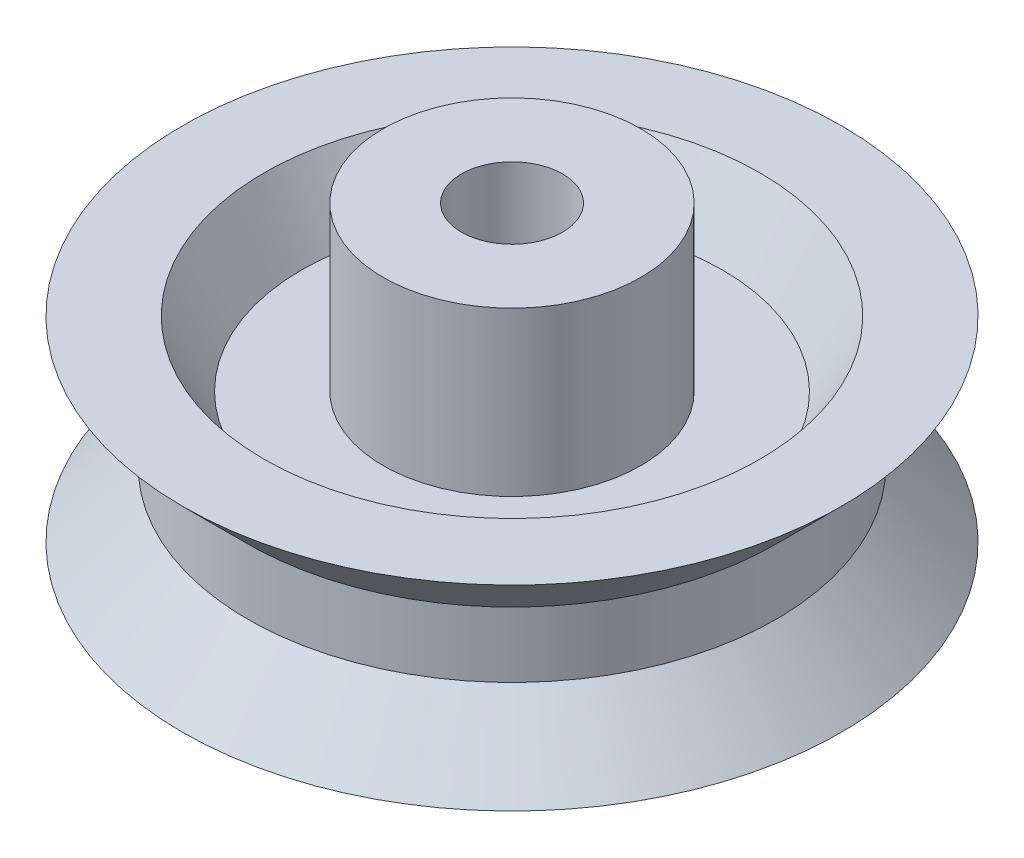
ISO-10303-21;
HEADER;
FILE_DESCRIPTION(('STEP AP214'),'2;1');
FILE_NAME('part.step','',(''),(''),'','','');
FILE_SCHEMA(('AUTOMOTIVE_DESIGN { 1 0 10303 214 1 1 1 1 }'));
ENDSEC;
DATA;
#1=APPLICATION_CONTEXT('core data for automotive mechanical design processes');
#2=APPLICATION_PROTOCOL_DEFINITION('international standard','automotive_design',2000,#1);
#3=PRODUCT_CONTEXT('',#1,'mechanical');
#4=PRODUCT('Part','Part','',(#3));
#5=PRODUCT_RELATED_PRODUCT_CATEGORY('part','',(#4));
#6=PRODUCT_DEFINITION_FORMATION('','',#4);
#7=PRODUCT_DEFINITION_CONTEXT('part definition',#1,'design');
#8=PRODUCT_DEFINITION('design','',#6,#7);
#9=PRODUCT_DEFINITION_SHAPE('','',#8);
#10=(LENGTH_UNIT() NAMED_UNIT(*) SI_UNIT(.MILLI.,.METRE.));
#11=(NAMED_UNIT(*) PLANE_ANGLE_UNIT() SI_UNIT($,.RADIAN.));
#12=(NAMED_UNIT(*) SI_UNIT($,.STERADIAN.) SOLID_ANGLE_UNIT());
#13=UNCERTAINTY_MEASURE_WITH_UNIT(LENGTH_MEASURE(1.E-05),#10,'distance_accuracy_value','');
#14=(GEOMETRIC_REPRESENTATION_CONTEXT(3) GLOBAL_UNCERTAINTY_ASSIGNED_CONTEXT((#13)) GLOBAL_UNIT_ASSIGNED_CONTEXT((#10,
#11,#12)) REPRESENTATION_CONTEXT('',''));
#15=CARTESIAN_POINT('',(0.,0.,0.));
#16=DIRECTION('',(0.,0.,1.));
#17=DIRECTION('',(1.,0.,0.));
#18=AXIS2_PLACEMENT_3D('',#15,#16,#17);
#19=CARTESIAN_POINT('',(0.,-4.99999999999999,-1.55));
#20=DIRECTION('',(0.,-1.,0.));
#21=DIRECTION('',(0.,0.,-1.));
#22=AXIS2_PLACEMENT_3D('',#19,#20,#21);
#23=PLANE('',#22);
#24=CARTESIAN_POINT('',(0.,-4.99999999999999,0.));
#25=DIRECTION('',(0.,-1.,0.));
#26=DIRECTION('',(0.,0.,-1.));
#27=AXIS2_PLACEMENT_3D('',#24,#25,#26);
#28=CIRCLE('',#27,3.94999999999998);
#29=CARTESIAN_POINT('',(0.,-4.99999999999999,-3.94999999999998));
#30=VERTEX_POINT('',#29);
#31=EDGE_CURVE('E10',#30,#30,#28,.T.);
#32=ORIENTED_EDGE('',*,*,#31,.T.);
#33=EDGE_LOOP('',(#32));
#34=FACE_BOUND('',#33,.T.);
#35=CARTESIAN_POINT('',(0.,-4.99999999999999,0.));
#36=DIRECTION('',(0.,-1.,0.));
#37=DIRECTION('',(0.,0.,-1.));
#38=AXIS2_PLACEMENT_3D('',#35,#36,#37);
#39=CIRCLE('',#38,1.55);
#40=CARTESIAN_POINT('',(0.,-4.99999999999999,-1.55));
#41=VERTEX_POINT('',#40);
#42=EDGE_CURVE('E77',#41,#41,#39,.T.);
#43=ORIENTED_EDGE('',*,*,#42,.F.);
#44=EDGE_LOOP('',(#43));
#45=FACE_BOUND('',#44,.T.);
#46=ADVANCED_FACE('F31',(#34,#45),#23,.T.);
#47=CARTESIAN_POINT('',(0.,0.,0.));
#48=DIRECTION('',(0.,-1.,0.));
#49=DIRECTION('',(0.,0.,-1.));
#50=AXIS2_PLACEMENT_3D('',#47,#48,#49);
#51=CYLINDRICAL_SURFACE('',#50,3.94999999999999);
#52=CARTESIAN_POINT('',(0.,0.,0.));
#53=DIRECTION('',(0.,-1.,0.));
#54=DIRECTION('',(0.,0.,-1.));
#55=AXIS2_PLACEMENT_3D('',#52,#53,#54);
#56=CIRCLE('',#55,3.95);
#57=CARTESIAN_POINT('',(0.,0.,-3.95));
#58=VERTEX_POINT('',#57);
#59=EDGE_CURVE('E37',#58,#58,#56,.T.);
#60=ORIENTED_EDGE('',*,*,#59,.T.);
#61=EDGE_LOOP('',(#60));
#62=FACE_BOUND('',#61,.T.);
#63=ORIENTED_EDGE('',*,*,#31,.F.);
#64=EDGE_LOOP('',(#63));
#65=FACE_BOUND('',#64,.T.);
#66=ADVANCED_FACE('F85',(#62,#65),#51,.T.);
#67=CARTESIAN_POINT('',(0.,0.,-3.95));
#68=DIRECTION('',(0.,-1.,0.));
#69=DIRECTION('',(0.,0.,-1.));
#70=AXIS2_PLACEMENT_3D('',#67,#68,#69);
#71=PLANE('',#70);
#72=CARTESIAN_POINT('',(0.,0.,0.));
#73=DIRECTION('',(0.,-1.,0.));
#74=DIRECTION('',(0.,0.,-1.));
#75=AXIS2_PLACEMENT_3D('',#72,#73,#74);
#76=CIRCLE('',#75,6.45);
#77=CARTESIAN_POINT('',(0.,0.,-6.45));
#78=VERTEX_POINT('',#77);
#79=EDGE_CURVE('E41',#78,#78,#76,.T.);
#80=ORIENTED_EDGE('',*,*,#79,.T.);
#81=EDGE_LOOP('',(#80));
#82=FACE_BOUND('',#81,.T.);
#83=ORIENTED_EDGE('',*,*,#59,.F.);
#84=EDGE_LOOP('',(#83));
#85=FACE_BOUND('',#84,.T.);
#86=ADVANCED_FACE('F89',(#82,#85),#71,.T.);
#87=CARTESIAN_POINT('',(0.,0.,0.));
#88=DIRECTION('',(0.,-1.,0.));
#89=DIRECTION('',(0.,0.,-1.));
#90=AXIS2_PLACEMENT_3D('',#87,#88,#89);
#91=CONICAL_SURFACE('',#90,6.45,0.52359877559825);
#92=CARTESIAN_POINT('',(0.,-1.99999999999998,0.));
#93=DIRECTION('',(0.,-1.,0.));
#94=DIRECTION('',(0.,0.,-1.));
#95=AXIS2_PLACEMENT_3D('',#92,#93,#94);
#96=CIRCLE('',#95,7.60470053837912);
#97=CARTESIAN_POINT('',(0.,-1.99999999999998,-7.60470053837912));
#98=VERTEX_POINT('',#97);
#99=EDGE_CURVE('E45',#98,#98,#96,.T.);
#100=ORIENTED_EDGE('',*,*,#99,.T.);
#101=EDGE_LOOP('',(#100));
#102=FACE_BOUND('',#101,.T.);
#103=ORIENTED_EDGE('',*,*,#79,.F.);
#104=EDGE_LOOP('',(#103));
#105=FACE_BOUND('',#104,.T.);
#106=ADVANCED_FACE('F93',(#102,#105),#91,.F.);
#107=CARTESIAN_POINT('',(0.,-1.99999999999998,-7.60470053837912));
#108=DIRECTION('',(0.,-1.,0.));
#109=DIRECTION('',(0.,0.,-1.));
#110=AXIS2_PLACEMENT_3D('',#107,#108,#109);
#111=PLANE('',#110);
#112=CARTESIAN_POINT('',(0.,-1.99999999999999,0.));
#113=DIRECTION('',(0.,-1.,0.));
#114=DIRECTION('',(0.,0.,-1.));
#115=AXIS2_PLACEMENT_3D('',#112,#113,#114);
#116=CIRCLE('',#115,10.1047005383792);
#117=CARTESIAN_POINT('',(0.,-1.99999999999999,-10.1047005383792));
#118=VERTEX_POINT('',#117);
#119=EDGE_CURVE('E50',#118,#118,#116,.T.);
#120=ORIENTED_EDGE('',*,*,#119,.T.);
#121=EDGE_LOOP('',(#120));
#122=FACE_BOUND('',#121,.T.);
#123=ORIENTED_EDGE('',*,*,#99,.F.);
#124=EDGE_LOOP('',(#123));
#125=FACE_BOUND('',#124,.T.);
#126=ADVANCED_FACE('F100',(#122,#125),#111,.T.);
#127=CARTESIAN_POINT('',(0.,-1.99999999999999,0.));
#128=DIRECTION('',(0.,-1.,0.));
#129=DIRECTION('',(0.,0.,-1.));
#130=AXIS2_PLACEMENT_3D('',#127,#128,#129);
#131=CONICAL_SURFACE('',#130,10.1047005383792,0.78539816339745);
#132=CARTESIAN_POINT('',(0.,0.,0.));
#133=DIRECTION('',(0.,-1.,0.));
#134=DIRECTION('',(0.,0.,-1.));
#135=AXIS2_PLACEMENT_3D('',#132,#133,#134);
#136=CIRCLE('',#135,8.10470053837923);
#137=CARTESIAN_POINT('',(0.,0.,-8.10470053837923));
#138=VERTEX_POINT('',#137);
#139=EDGE_CURVE('E53',#138,#138,#136,.T.);
#140=ORIENTED_EDGE('',*,*,#139,.T.);
#141=EDGE_LOOP('',(#140));
#142=FACE_BOUND('',#141,.T.);
#143=ORIENTED_EDGE('',*,*,#119,.F.);
#144=EDGE_LOOP('',(#143));
#145=FACE_BOUND('',#144,.T.);
#146=ADVANCED_FACE('F104',(#142,#145),#131,.T.);
#147=CARTESIAN_POINT('',(0.,0.,0.));
#148=DIRECTION('',(0.,-1.,0.));
#149=DIRECTION('',(0.,0.,-1.));
#150=AXIS2_PLACEMENT_3D('',#147,#148,#149);
#151=CYLINDRICAL_SURFACE('',#150,8.10470053837923);
#152=CARTESIAN_POINT('',(0.,2.00000000000001,0.));
#153=DIRECTION('',(0.,-1.,0.));
#154=DIRECTION('',(0.,0.,-1.));
#155=AXIS2_PLACEMENT_3D('',#152,#153,#154);
#156=CIRCLE('',#155,8.10470053837923);
#157=CARTESIAN_POINT('',(0.,2.00000000000001,-8.10470053837923));
#158=VERTEX_POINT('',#157);
#159=EDGE_CURVE('E56',#158,#158,#156,.T.);
#160=ORIENTED_EDGE('',*,*,#159,.T.);
#161=EDGE_LOOP('',(#160));
#162=FACE_BOUND('',#161,.T.);
#163=ORIENTED_EDGE('',*,*,#139,.F.);
#164=EDGE_LOOP('',(#163));
#165=FACE_BOUND('',#164,.T.);
#166=ADVANCED_FACE('F108',(#162,#165),#151,.T.);
#167=CARTESIAN_POINT('',(0.,2.00000000000001,0.));
#168=DIRECTION('',(0.,1.,0.));
#169=DIRECTION('',(0.,0.,1.));
#170=AXIS2_PLACEMENT_3D('',#167,#168,#169);
#171=CONICAL_SURFACE('',#170,8.10470053837923,0.785398163397423);
#172=CARTESIAN_POINT('',(0.,4.00000000000001,0.));
#173=DIRECTION('',(0.,-1.,0.));
#174=DIRECTION('',(0.,0.,-1.));
#175=AXIS2_PLACEMENT_3D('',#172,#173,#174);
#176=CIRCLE('',#175,10.1047005383791);
#177=CARTESIAN_POINT('',(0.,4.00000000000001,-10.1047005383791));
#178=VERTEX_POINT('',#177);
#179=EDGE_CURVE('E59',#178,#178,#176,.T.);
#180=ORIENTED_EDGE('',*,*,#179,.T.);
#181=EDGE_LOOP('',(#180));
#182=FACE_BOUND('',#181,.T.);
#183=ORIENTED_EDGE('',*,*,#159,.F.);
#184=EDGE_LOOP('',(#183));
#185=FACE_BOUND('',#184,.T.);
#186=ADVANCED_FACE('F112',(#182,#185),#171,.T.);
#187=CARTESIAN_POINT('',(0.,4.00000000000002,-10.1047005383791));
#188=DIRECTION('',(0.,1.,0.));
#189=DIRECTION('',(0.,0.,1.));
#190=AXIS2_PLACEMENT_3D('',#187,#188,#189);
#191=PLANE('',#190);
#192=CARTESIAN_POINT('',(0.,4.00000000000002,0.));
#193=DIRECTION('',(0.,-1.,0.));
#194=DIRECTION('',(0.,0.,-1.));
#195=AXIS2_PLACEMENT_3D('',#192,#193,#194);
#196=CIRCLE('',#195,7.60470053837912);
#197=CARTESIAN_POINT('',(0.,4.00000000000002,-7.60470053837912));
#198=VERTEX_POINT('',#197);
#199=EDGE_CURVE('E62',#198,#198,#196,.T.);
#200=ORIENTED_EDGE('',*,*,#199,.T.);
#201=EDGE_LOOP('',(#200));
#202=FACE_BOUND('',#201,.T.);
#203=ORIENTED_EDGE('',*,*,#179,.F.);
#204=EDGE_LOOP('',(#203));
#205=FACE_BOUND('',#204,.T.);
#206=ADVANCED_FACE('F116',(#202,#205),#191,.T.);
#207=CARTESIAN_POINT('',(0.,4.00000000000002,0.));
#208=DIRECTION('',(0.,1.,0.));
#209=DIRECTION('',(0.,0.,1.));
#210=AXIS2_PLACEMENT_3D('',#207,#208,#209);
#211=CONICAL_SURFACE('',#210,7.60470053837912,0.523598775598296);
#212=CARTESIAN_POINT('',(0.,2.00000000000002,0.));
#213=DIRECTION('',(0.,-1.,0.));
#214=DIRECTION('',(0.,0.,-1.));
#215=AXIS2_PLACEMENT_3D('',#212,#213,#214);
#216=CIRCLE('',#215,6.44999999999988);
#217=CARTESIAN_POINT('',(0.,2.00000000000002,-6.44999999999988));
#218=VERTEX_POINT('',#217);
#219=EDGE_CURVE('E65',#218,#218,#216,.T.);
#220=ORIENTED_EDGE('',*,*,#219,.T.);
#221=EDGE_LOOP('',(#220));
#222=FACE_BOUND('',#221,.T.);
#223=ORIENTED_EDGE('',*,*,#199,.F.);
#224=EDGE_LOOP('',(#223));
#225=FACE_BOUND('',#224,.T.);
#226=ADVANCED_FACE('F120',(#222,#225),#211,.F.);
#227=CARTESIAN_POINT('',(0.,2.00000000000001,-6.44999999999988));
#228=DIRECTION('',(0.,1.,0.));
#229=DIRECTION('',(0.,0.,1.));
#230=AXIS2_PLACEMENT_3D('',#227,#228,#229);
#231=PLANE('',#230);
#232=CARTESIAN_POINT('',(0.,2.00000000000001,0.));
#233=DIRECTION('',(0.,-1.,0.));
#234=DIRECTION('',(0.,0.,-1.));
#235=AXIS2_PLACEMENT_3D('',#232,#233,#234);
#236=CIRCLE('',#235,3.95);
#237=CARTESIAN_POINT('',(0.,2.00000000000001,-3.95));
#238=VERTEX_POINT('',#237);
#239=EDGE_CURVE('E68',#238,#238,#236,.T.);
#240=ORIENTED_EDGE('',*,*,#239,.T.);
#241=EDGE_LOOP('',(#240));
#242=FACE_BOUND('',#241,.T.);
#243=ORIENTED_EDGE('',*,*,#219,.F.);
#244=EDGE_LOOP('',(#243));
#245=FACE_BOUND('',#244,.T.);
#246=ADVANCED_FACE('F124',(#242,#245),#231,.T.);
#247=CARTESIAN_POINT('',(0.,0.,0.));
#248=DIRECTION('',(0.,-1.,0.));
#249=DIRECTION('',(0.,0.,-1.));
#250=AXIS2_PLACEMENT_3D('',#247,#248,#249);
#251=CYLINDRICAL_SURFACE('',#250,3.95);
#252=CARTESIAN_POINT('',(0.,7.00000000000001,0.));
#253=DIRECTION('',(0.,-1.,0.));
#254=DIRECTION('',(0.,0.,-1.));
#255=AXIS2_PLACEMENT_3D('',#252,#253,#254);
#256=CIRCLE('',#255,3.95);
#257=CARTESIAN_POINT('',(0.,7.00000000000001,-3.95));
#258=VERTEX_POINT('',#257);
#259=EDGE_CURVE('E71',#258,#258,#256,.T.);
#260=ORIENTED_EDGE('',*,*,#259,.T.);
#261=EDGE_LOOP('',(#260));
#262=FACE_BOUND('',#261,.T.);
#263=ORIENTED_EDGE('',*,*,#239,.F.);
#264=EDGE_LOOP('',(#263));
#265=FACE_BOUND('',#264,.T.);
#266=ADVANCED_FACE('F128',(#262,#265),#251,.T.);
#267=CARTESIAN_POINT('',(0.,7.00000000000001,-3.95));
#268=DIRECTION('',(0.,1.,0.));
#269=DIRECTION('',(0.,0.,1.));
#270=AXIS2_PLACEMENT_3D('',#267,#268,#269);
#271=PLANE('',#270);
#272=CARTESIAN_POINT('',(0.,7.00000000000001,0.));
#273=DIRECTION('',(0.,-1.,0.));
#274=DIRECTION('',(0.,0.,-1.));
#275=AXIS2_PLACEMENT_3D('',#272,#273,#274);
#276=CIRCLE('',#275,1.55);
#277=CARTESIAN_POINT('',(0.,7.00000000000001,-1.55));
#278=VERTEX_POINT('',#277);
#279=EDGE_CURVE('E74',#278,#278,#276,.T.);
#280=ORIENTED_EDGE('',*,*,#279,.T.);
#281=EDGE_LOOP('',(#280));
#282=FACE_BOUND('',#281,.T.);
#283=ORIENTED_EDGE('',*,*,#259,.F.);
#284=EDGE_LOOP('',(#283));
#285=FACE_BOUND('',#284,.T.);
#286=ADVANCED_FACE('F132',(#282,#285),#271,.T.);
#287=CARTESIAN_POINT('',(0.,0.,0.));
#288=DIRECTION('',(0.,-1.,0.));
#289=DIRECTION('',(0.,0.,-1.));
#290=AXIS2_PLACEMENT_3D('',#287,#288,#289);
#291=CYLINDRICAL_SURFACE('',#290,1.55);
#292=ORIENTED_EDGE('',*,*,#42,.T.);
#293=EDGE_LOOP('',(#292));
#294=FACE_BOUND('',#293,.T.);
#295=ORIENTED_EDGE('',*,*,#279,.F.);
#296=EDGE_LOOP('',(#295));
#297=FACE_BOUND('',#296,.T.);
#298=ADVANCED_FACE('F81',(#294,#297),#291,.F.);
#299=CLOSED_SHELL('',(#46,#66,#86,#106,#126,#146,#166,#186,#206,#226,#246,#266,#286,#298));
#300=MANIFOLD_SOLID_BREP('B2',#299);
#301=ADVANCED_BREP_SHAPE_REPRESENTATION('',(#18,#300),#14);
#302=SHAPE_DEFINITION_REPRESENTATION(#9,#301);
ENDSEC;
END-ISO-10303-21;
